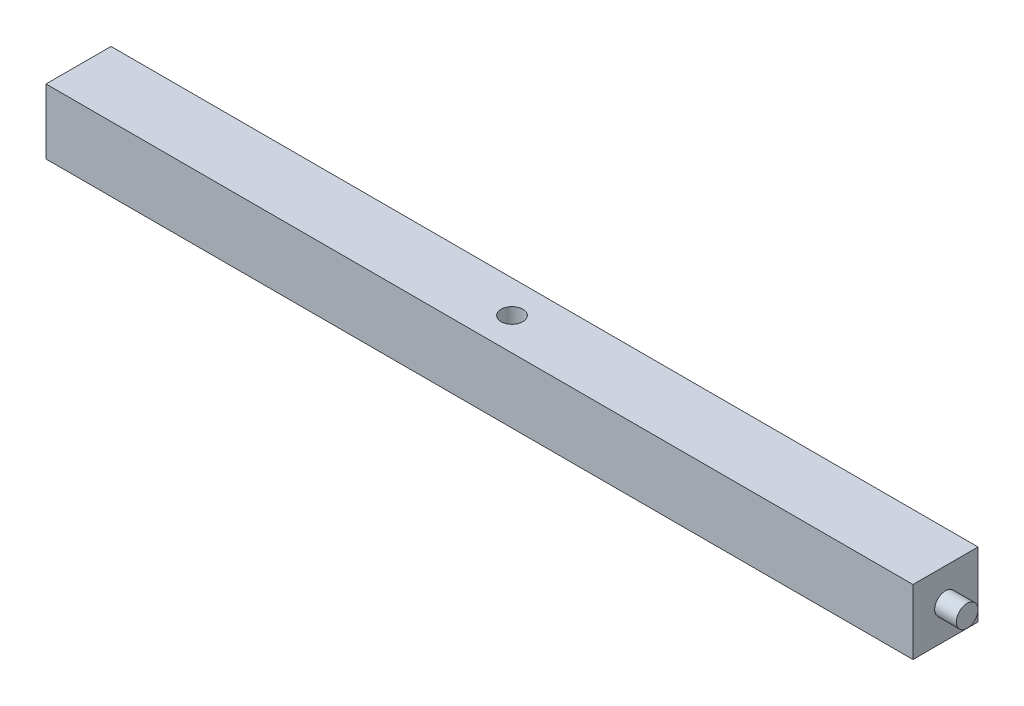
ISO-10303-21;
HEADER;
FILE_DESCRIPTION(('STEP AP214'),'2;1');
FILE_NAME('part.step','',(''),(''),'','','');
FILE_SCHEMA(('AUTOMOTIVE_DESIGN { 1 0 10303 214 1 1 1 1 }'));
ENDSEC;
DATA;
#1=APPLICATION_CONTEXT('core data for automotive mechanical design processes');
#2=APPLICATION_PROTOCOL_DEFINITION('international standard','automotive_design',2000,#1);
#3=PRODUCT_CONTEXT('',#1,'mechanical');
#4=PRODUCT('Part','Part','',(#3));
#5=PRODUCT_RELATED_PRODUCT_CATEGORY('part','',(#4));
#6=PRODUCT_DEFINITION_FORMATION('','',#4);
#7=PRODUCT_DEFINITION_CONTEXT('part definition',#1,'design');
#8=PRODUCT_DEFINITION('design','',#6,#7);
#9=PRODUCT_DEFINITION_SHAPE('','',#8);
#10=(LENGTH_UNIT() NAMED_UNIT(*) SI_UNIT(.MILLI.,.METRE.));
#11=(NAMED_UNIT(*) PLANE_ANGLE_UNIT() SI_UNIT($,.RADIAN.));
#12=(NAMED_UNIT(*) SI_UNIT($,.STERADIAN.) SOLID_ANGLE_UNIT());
#13=UNCERTAINTY_MEASURE_WITH_UNIT(LENGTH_MEASURE(1.E-05),#10,'distance_accuracy_value','');
#14=(GEOMETRIC_REPRESENTATION_CONTEXT(3) GLOBAL_UNCERTAINTY_ASSIGNED_CONTEXT((#13)) GLOBAL_UNIT_ASSIGNED_CONTEXT((#10,
#11,#12)) REPRESENTATION_CONTEXT('',''));
#15=CARTESIAN_POINT('',(0.,0.,0.));
#16=DIRECTION('',(0.,0.,1.));
#17=DIRECTION('',(1.,0.,0.));
#18=AXIS2_PLACEMENT_3D('',#15,#16,#17);
#19=CARTESIAN_POINT('',(254.,38.1,-19.05));
#20=DIRECTION('',(-1.,0.,0.));
#21=DIRECTION('',(0.,0.,1.));
#22=AXIS2_PLACEMENT_3D('',#19,#20,#21);
#23=PLANE('',#22);
#24=CARTESIAN_POINT('',(254.,19.05,0.));
#25=DIRECTION('',(1.,0.,0.));
#26=DIRECTION('',(0.,0.,-1.));
#27=AXIS2_PLACEMENT_3D('',#24,#25,#26);
#28=CIRCLE('',#27,6.35);
#29=CARTESIAN_POINT('',(254.,19.05,-6.35));
#30=VERTEX_POINT('',#29);
#31=EDGE_CURVE('E11',#30,#30,#28,.T.);
#32=ORIENTED_EDGE('',*,*,#31,.F.);
#33=EDGE_LOOP('',(#32));
#34=FACE_BOUND('',#33,.T.);
#35=DIRECTION('',(0.,0.,-1.));
#36=VECTOR('',#35,1.);
#37=CARTESIAN_POINT('',(254.,0.,-19.05));
#38=LINE('',#37,#36);
#39=CARTESIAN_POINT('',(254.,0.,19.05));
#40=VERTEX_POINT('',#39);
#41=CARTESIAN_POINT('',(254.,0.,-19.05));
#42=VERTEX_POINT('',#41);
#43=EDGE_CURVE('E99',#40,#42,#38,.T.);
#44=ORIENTED_EDGE('',*,*,#43,.T.);
#45=DIRECTION('',(0.,-1.,0.));
#46=VECTOR('',#45,1.);
#47=CARTESIAN_POINT('',(254.,38.1,-19.05));
#48=LINE('',#47,#46);
#49=CARTESIAN_POINT('',(254.,38.1,-19.05));
#50=VERTEX_POINT('',#49);
#51=EDGE_CURVE('E35',#50,#42,#48,.T.);
#52=ORIENTED_EDGE('',*,*,#51,.F.);
#53=DIRECTION('',(0.,0.,-1.));
#54=VECTOR('',#53,1.);
#55=CARTESIAN_POINT('',(254.,38.1,-19.05));
#56=LINE('',#55,#54);
#57=CARTESIAN_POINT('',(254.,38.1,19.05));
#58=VERTEX_POINT('',#57);
#59=EDGE_CURVE('E86',#58,#50,#56,.T.);
#60=ORIENTED_EDGE('',*,*,#59,.F.);
#61=DIRECTION('',(0.,-1.,0.));
#62=VECTOR('',#61,1.);
#63=CARTESIAN_POINT('',(254.,38.1,19.05));
#64=LINE('',#63,#62);
#65=EDGE_CURVE('E95',#58,#40,#64,.T.);
#66=ORIENTED_EDGE('',*,*,#65,.T.);
#67=EDGE_LOOP('',(#44,#52,#60,#66));
#68=FACE_BOUND('',#67,.T.);
#69=ADVANCED_FACE('F32',(#34,#68),#23,.F.);
#70=CARTESIAN_POINT('',(-254.,38.1,-19.05));
#71=DIRECTION('',(0.,0.,1.));
#72=DIRECTION('',(1.,0.,0.));
#73=AXIS2_PLACEMENT_3D('',#70,#71,#72);
#74=PLANE('',#73);
#75=DIRECTION('',(-1.,0.,0.));
#76=VECTOR('',#75,1.);
#77=CARTESIAN_POINT('',(-254.,0.,-19.05));
#78=LINE('',#77,#76);
#79=CARTESIAN_POINT('',(-254.,0.,-19.05));
#80=VERTEX_POINT('',#79);
#81=EDGE_CURVE('E91',#42,#80,#78,.T.);
#82=ORIENTED_EDGE('',*,*,#81,.T.);
#83=DIRECTION('',(0.,-1.,0.));
#84=VECTOR('',#83,1.);
#85=CARTESIAN_POINT('',(-254.,38.1,-19.05));
#86=LINE('',#85,#84);
#87=CARTESIAN_POINT('',(-254.,38.1,-19.05));
#88=VERTEX_POINT('',#87);
#89=EDGE_CURVE('E89',#88,#80,#86,.T.);
#90=ORIENTED_EDGE('',*,*,#89,.F.);
#91=DIRECTION('',(-1.,0.,0.));
#92=VECTOR('',#91,1.);
#93=CARTESIAN_POINT('',(-254.,38.1,-19.05));
#94=LINE('',#93,#92);
#95=EDGE_CURVE('E81',#50,#88,#94,.T.);
#96=ORIENTED_EDGE('',*,*,#95,.F.);
#97=ORIENTED_EDGE('',*,*,#51,.T.);
#98=EDGE_LOOP('',(#82,#90,#96,#97));
#99=FACE_BOUND('',#98,.T.);
#100=ADVANCED_FACE('F90',(#99),#74,.F.);
#101=CARTESIAN_POINT('',(-254.,38.1,-19.05));
#102=DIRECTION('',(1.,0.,0.));
#103=DIRECTION('',(0.,0.,-1.));
#104=AXIS2_PLACEMENT_3D('',#101,#102,#103);
#105=PLANE('',#104);
#106=CARTESIAN_POINT('',(-254.,19.05,0.));
#107=DIRECTION('',(-1.,0.,0.));
#108=DIRECTION('',(0.,0.,1.));
#109=AXIS2_PLACEMENT_3D('',#106,#107,#108);
#110=CIRCLE('',#109,6.35);
#111=CARTESIAN_POINT('',(-254.,19.05,6.35));
#112=VERTEX_POINT('',#111);
#113=EDGE_CURVE('E41',#112,#112,#110,.T.);
#114=ORIENTED_EDGE('',*,*,#113,.F.);
#115=EDGE_LOOP('',(#114));
#116=FACE_BOUND('',#115,.T.);
#117=DIRECTION('',(0.,0.,1.));
#118=VECTOR('',#117,1.);
#119=CARTESIAN_POINT('',(-254.,0.,-19.05));
#120=LINE('',#119,#118);
#121=CARTESIAN_POINT('',(-254.,0.,19.05));
#122=VERTEX_POINT('',#121);
#123=EDGE_CURVE('E67',#80,#122,#120,.T.);
#124=ORIENTED_EDGE('',*,*,#123,.T.);
#125=DIRECTION('',(0.,-1.,0.));
#126=VECTOR('',#125,1.);
#127=CARTESIAN_POINT('',(-254.,38.1,19.05));
#128=LINE('',#127,#126);
#129=CARTESIAN_POINT('',(-254.,38.1,19.05));
#130=VERTEX_POINT('',#129);
#131=EDGE_CURVE('E92',#130,#122,#128,.T.);
#132=ORIENTED_EDGE('',*,*,#131,.F.);
#133=DIRECTION('',(0.,0.,1.));
#134=VECTOR('',#133,1.);
#135=CARTESIAN_POINT('',(-254.,38.1,-19.05));
#136=LINE('',#135,#134);
#137=EDGE_CURVE('E84',#88,#130,#136,.T.);
#138=ORIENTED_EDGE('',*,*,#137,.F.);
#139=ORIENTED_EDGE('',*,*,#89,.T.);
#140=EDGE_LOOP('',(#124,#132,#138,#139));
#141=FACE_BOUND('',#140,.T.);
#142=ADVANCED_FACE('F93',(#116,#141),#105,.F.);
#143=CARTESIAN_POINT('',(-254.,38.1,19.05));
#144=DIRECTION('',(0.,0.,-1.));
#145=DIRECTION('',(-1.,0.,0.));
#146=AXIS2_PLACEMENT_3D('',#143,#144,#145);
#147=PLANE('',#146);
#148=DIRECTION('',(1.,0.,0.));
#149=VECTOR('',#148,1.);
#150=CARTESIAN_POINT('',(-254.,0.,19.05));
#151=LINE('',#150,#149);
#152=EDGE_CURVE('E73',#122,#40,#151,.T.);
#153=ORIENTED_EDGE('',*,*,#152,.T.);
#154=ORIENTED_EDGE('',*,*,#65,.F.);
#155=DIRECTION('',(1.,0.,0.));
#156=VECTOR('',#155,1.);
#157=CARTESIAN_POINT('',(-254.,38.1,19.05));
#158=LINE('',#157,#156);
#159=EDGE_CURVE('E50',#130,#58,#158,.T.);
#160=ORIENTED_EDGE('',*,*,#159,.F.);
#161=ORIENTED_EDGE('',*,*,#131,.T.);
#162=EDGE_LOOP('',(#153,#154,#160,#161));
#163=FACE_BOUND('',#162,.T.);
#164=ADVANCED_FACE('F107',(#163),#147,.F.);
#165=CARTESIAN_POINT('',(0.,38.1,0.));
#166=DIRECTION('',(0.,1.,0.));
#167=DIRECTION('',(0.,0.,1.));
#168=AXIS2_PLACEMENT_3D('',#165,#166,#167);
#169=PLANE('',#168);
#170=CARTESIAN_POINT('',(0.,38.1,0.));
#171=DIRECTION('',(0.,1.,0.));
#172=DIRECTION('',(0.,0.,1.));
#173=AXIS2_PLACEMENT_3D('',#170,#171,#172);
#174=CIRCLE('',#173,6.35);
#175=CARTESIAN_POINT('',(0.,38.1,6.35));
#176=VERTEX_POINT('',#175);
#177=EDGE_CURVE('E121',#176,#176,#174,.T.);
#178=ORIENTED_EDGE('',*,*,#177,.F.);
#179=EDGE_LOOP('',(#178));
#180=FACE_BOUND('',#179,.T.);
#181=ORIENTED_EDGE('',*,*,#59,.T.);
#182=ORIENTED_EDGE('',*,*,#95,.T.);
#183=ORIENTED_EDGE('',*,*,#137,.T.);
#184=ORIENTED_EDGE('',*,*,#159,.T.);
#185=EDGE_LOOP('',(#181,#182,#183,#184));
#186=FACE_BOUND('',#185,.T.);
#187=ADVANCED_FACE('F82',(#180,#186),#169,.T.);
#188=CARTESIAN_POINT('',(0.,0.,0.));
#189=DIRECTION('',(0.,1.,0.));
#190=DIRECTION('',(0.,0.,1.));
#191=AXIS2_PLACEMENT_3D('',#188,#189,#190);
#192=PLANE('',#191);
#193=ORIENTED_EDGE('',*,*,#43,.F.);
#194=ORIENTED_EDGE('',*,*,#152,.F.);
#195=ORIENTED_EDGE('',*,*,#123,.F.);
#196=ORIENTED_EDGE('',*,*,#81,.F.);
#197=EDGE_LOOP('',(#193,#194,#195,#196));
#198=FACE_BOUND('',#197,.T.);
#199=ADVANCED_FACE('F110',(#198),#192,.F.);
#200=CARTESIAN_POINT('',(-266.7,19.05,0.));
#201=DIRECTION('',(1.,0.,0.));
#202=DIRECTION('',(0.,0.,-1.));
#203=AXIS2_PLACEMENT_3D('',#200,#201,#202);
#204=CYLINDRICAL_SURFACE('',#203,6.35);
#205=CARTESIAN_POINT('',(-266.7,19.05,0.));
#206=DIRECTION('',(-1.,0.,0.));
#207=DIRECTION('',(0.,0.,1.));
#208=AXIS2_PLACEMENT_3D('',#205,#206,#207);
#209=CIRCLE('',#208,6.35);
#210=CARTESIAN_POINT('',(-266.7,19.05,6.35));
#211=VERTEX_POINT('',#210);
#212=EDGE_CURVE('E102',#211,#211,#209,.T.);
#213=ORIENTED_EDGE('',*,*,#212,.F.);
#214=EDGE_LOOP('',(#213));
#215=FACE_BOUND('',#214,.T.);
#216=ORIENTED_EDGE('',*,*,#113,.T.);
#217=EDGE_LOOP('',(#216));
#218=FACE_BOUND('',#217,.T.);
#219=ADVANCED_FACE('F142',(#215,#218),#204,.T.);
#220=CARTESIAN_POINT('',(-266.7,19.05,0.));
#221=DIRECTION('',(-1.,0.,0.));
#222=DIRECTION('',(0.,0.,1.));
#223=AXIS2_PLACEMENT_3D('',#220,#221,#222);
#224=PLANE('',#223);
#225=ORIENTED_EDGE('',*,*,#212,.T.);
#226=EDGE_LOOP('',(#225));
#227=FACE_BOUND('',#226,.T.);
#228=ADVANCED_FACE('F155',(#227),#224,.T.);
#229=CARTESIAN_POINT('',(266.7,19.05,0.));
#230=DIRECTION('',(-1.,0.,0.));
#231=DIRECTION('',(0.,0.,1.));
#232=AXIS2_PLACEMENT_3D('',#229,#230,#231);
#233=CYLINDRICAL_SURFACE('',#232,6.35);
#234=CARTESIAN_POINT('',(266.7,19.05,0.));
#235=DIRECTION('',(1.,0.,0.));
#236=DIRECTION('',(0.,0.,-1.));
#237=AXIS2_PLACEMENT_3D('',#234,#235,#236);
#238=CIRCLE('',#237,6.35);
#239=CARTESIAN_POINT('',(266.7,19.05,-6.35));
#240=VERTEX_POINT('',#239);
#241=EDGE_CURVE('E116',#240,#240,#238,.T.);
#242=ORIENTED_EDGE('',*,*,#241,.F.);
#243=EDGE_LOOP('',(#242));
#244=FACE_BOUND('',#243,.T.);
#245=ORIENTED_EDGE('',*,*,#31,.T.);
#246=EDGE_LOOP('',(#245));
#247=FACE_BOUND('',#246,.T.);
#248=ADVANCED_FACE('F153',(#244,#247),#233,.T.);
#249=CARTESIAN_POINT('',(266.7,19.05,0.));
#250=DIRECTION('',(1.,0.,0.));
#251=DIRECTION('',(0.,0.,-1.));
#252=AXIS2_PLACEMENT_3D('',#249,#250,#251);
#253=PLANE('',#252);
#254=ORIENTED_EDGE('',*,*,#241,.T.);
#255=EDGE_LOOP('',(#254));
#256=FACE_BOUND('',#255,.T.);
#257=ADVANCED_FACE('F132',(#256),#253,.T.);
#258=CARTESIAN_POINT('',(0.,25.4,0.));
#259=DIRECTION('',(0.,1.,0.));
#260=DIRECTION('',(0.,0.,1.));
#261=AXIS2_PLACEMENT_3D('',#258,#259,#260);
#262=CYLINDRICAL_SURFACE('',#261,6.35);
#263=CARTESIAN_POINT('',(0.,25.4,0.));
#264=DIRECTION('',(0.,1.,0.));
#265=DIRECTION('',(0.,0.,1.));
#266=AXIS2_PLACEMENT_3D('',#263,#264,#265);
#267=CIRCLE('',#266,6.35);
#268=CARTESIAN_POINT('',(0.,25.4,6.35));
#269=VERTEX_POINT('',#268);
#270=EDGE_CURVE('E120',#269,#269,#267,.T.);
#271=ORIENTED_EDGE('',*,*,#270,.F.);
#272=EDGE_LOOP('',(#271));
#273=FACE_BOUND('',#272,.T.);
#274=ORIENTED_EDGE('',*,*,#177,.T.);
#275=EDGE_LOOP('',(#274));
#276=FACE_BOUND('',#275,.T.);
#277=ADVANCED_FACE('F129',(#273,#276),#262,.F.);
#278=CARTESIAN_POINT('',(0.,25.4,0.));
#279=DIRECTION('',(0.,1.,0.));
#280=DIRECTION('',(0.,0.,1.));
#281=AXIS2_PLACEMENT_3D('',#278,#279,#280);
#282=PLANE('',#281);
#283=ORIENTED_EDGE('',*,*,#270,.T.);
#284=EDGE_LOOP('',(#283));
#285=FACE_BOUND('',#284,.T.);
#286=ADVANCED_FACE('F127',(#285),#282,.T.);
#287=CLOSED_SHELL('',(#69,#100,#142,#164,#187,#199,#219,#228,#248,#257,#277,#286));
#288=MANIFOLD_SOLID_BREP('B2',#287);
#289=ADVANCED_BREP_SHAPE_REPRESENTATION('',(#18,#288),#14);
#290=SHAPE_DEFINITION_REPRESENTATION(#9,#289);
ENDSEC;
END-ISO-10303-21;
